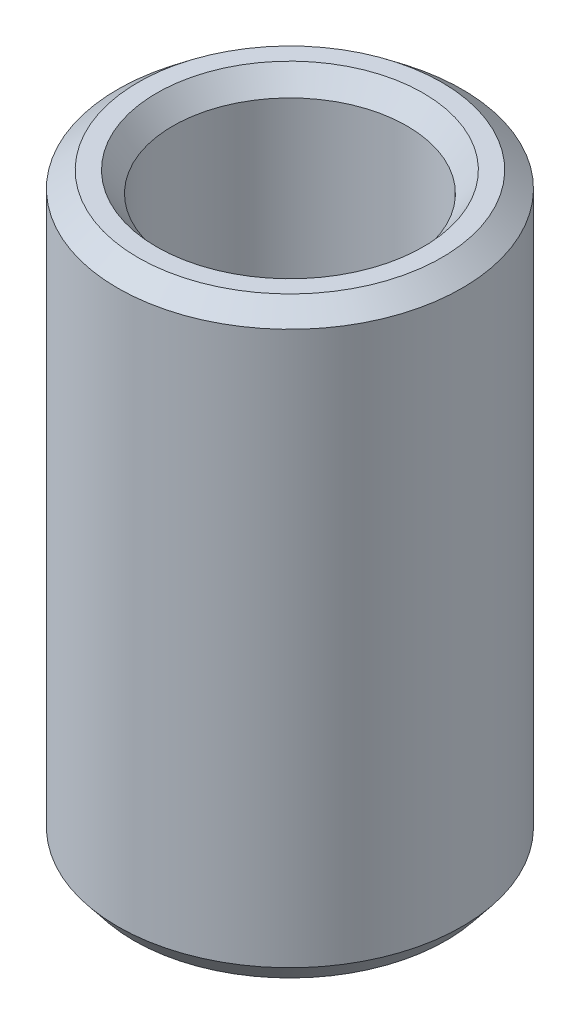
ISO-10303-21;
HEADER;
FILE_DESCRIPTION(('STEP AP214'),'2;1');
FILE_NAME('part.step','',(''),(''),'','','');
FILE_SCHEMA(('AUTOMOTIVE_DESIGN { 1 0 10303 214 1 1 1 1 }'));
ENDSEC;
DATA;
#1=APPLICATION_CONTEXT('core data for automotive mechanical design processes');
#2=APPLICATION_PROTOCOL_DEFINITION('international standard','automotive_design',2000,#1);
#3=PRODUCT_CONTEXT('',#1,'mechanical');
#4=PRODUCT('Part','Part','',(#3));
#5=PRODUCT_RELATED_PRODUCT_CATEGORY('part','',(#4));
#6=PRODUCT_DEFINITION_FORMATION('','',#4);
#7=PRODUCT_DEFINITION_CONTEXT('part definition',#1,'design');
#8=PRODUCT_DEFINITION('design','',#6,#7);
#9=PRODUCT_DEFINITION_SHAPE('','',#8);
#10=(LENGTH_UNIT() NAMED_UNIT(*) SI_UNIT(.MILLI.,.METRE.));
#11=(NAMED_UNIT(*) PLANE_ANGLE_UNIT() SI_UNIT($,.RADIAN.));
#12=(NAMED_UNIT(*) SI_UNIT($,.STERADIAN.) SOLID_ANGLE_UNIT());
#13=UNCERTAINTY_MEASURE_WITH_UNIT(LENGTH_MEASURE(1.E-05),#10,'distance_accuracy_value','');
#14=(GEOMETRIC_REPRESENTATION_CONTEXT(3) GLOBAL_UNCERTAINTY_ASSIGNED_CONTEXT((#13)) GLOBAL_UNIT_ASSIGNED_CONTEXT((#10,
#11,#12)) REPRESENTATION_CONTEXT('',''));
#15=CARTESIAN_POINT('',(0.,0.,0.));
#16=DIRECTION('',(0.,0.,1.));
#17=DIRECTION('',(1.,0.,0.));
#18=AXIS2_PLACEMENT_3D('',#15,#16,#17);
#19=CARTESIAN_POINT('',(0.,136.917324424175,0.));
#20=DIRECTION('',(0.,-1.,0.));
#21=DIRECTION('',(0.,0.,-1.));
#22=AXIS2_PLACEMENT_3D('',#19,#20,#21);
#23=CYLINDRICAL_SURFACE('',#22,40.);
#24=CARTESIAN_POINT('',(0.,4.72704175992167,0.));
#25=DIRECTION('',(0.,1.,0.));
#26=DIRECTION('',(0.,0.,1.));
#27=AXIS2_PLACEMENT_3D('',#24,#25,#26);
#28=CIRCLE('',#27,40.);
#29=CARTESIAN_POINT('',(0.,4.72704175992167,40.));
#30=VERTEX_POINT('',#29);
#31=EDGE_CURVE('E10',#30,#30,#28,.T.);
#32=ORIENTED_EDGE('',*,*,#31,.T.);
#33=EDGE_LOOP('',(#32));
#34=FACE_BOUND('',#33,.T.);
#35=CARTESIAN_POINT('',(0.,133.144575818901,0.));
#36=DIRECTION('',(0.,1.,0.));
#37=DIRECTION('',(0.,0.,1.));
#38=AXIS2_PLACEMENT_3D('',#35,#36,#37);
#39=CIRCLE('',#38,40.);
#40=CARTESIAN_POINT('',(0.,133.144575818901,40.));
#41=VERTEX_POINT('',#40);
#42=EDGE_CURVE('E50',#41,#41,#39,.F.);
#43=ORIENTED_EDGE('',*,*,#42,.T.);
#44=EDGE_LOOP('',(#43));
#45=FACE_BOUND('',#44,.T.);
#46=ADVANCED_FACE('F39',(#34,#45),#23,.T.);
#47=CARTESIAN_POINT('',(0.,136.917324424175,0.));
#48=DIRECTION('',(0.,1.,0.));
#49=DIRECTION('',(0.,0.,1.));
#50=AXIS2_PLACEMENT_3D('',#47,#48,#49);
#51=PLANE('',#50);
#52=CARTESIAN_POINT('',(0.,136.917324424175,0.));
#53=DIRECTION('',(0.,1.,0.));
#54=DIRECTION('',(0.,0.,1.));
#55=AXIS2_PLACEMENT_3D('',#52,#53,#54);
#56=CIRCLE('',#55,30.955657486322);
#57=CARTESIAN_POINT('',(0.,136.917324424175,30.955657486322));
#58=VERTEX_POINT('',#57);
#59=EDGE_CURVE('E58',#58,#58,#56,.F.);
#60=ORIENTED_EDGE('',*,*,#59,.T.);
#61=EDGE_LOOP('',(#60));
#62=FACE_BOUND('',#61,.T.);
#63=CARTESIAN_POINT('',(0.,136.917324424175,0.));
#64=DIRECTION('',(0.,1.,0.));
#65=DIRECTION('',(0.,0.,1.));
#66=AXIS2_PLACEMENT_3D('',#63,#64,#65);
#67=CIRCLE('',#66,35.2729582400783);
#68=CARTESIAN_POINT('',(0.,136.917324424175,35.2729582400783));
#69=VERTEX_POINT('',#68);
#70=EDGE_CURVE('E61',#69,#69,#67,.T.);
#71=ORIENTED_EDGE('',*,*,#70,.T.);
#72=EDGE_LOOP('',(#71));
#73=FACE_BOUND('',#72,.T.);
#74=ADVANCED_FACE('F88',(#62,#73),#51,.T.);
#75=CARTESIAN_POINT('',(0.,0.,0.));
#76=DIRECTION('',(0.,1.,0.));
#77=DIRECTION('',(0.,0.,1.));
#78=AXIS2_PLACEMENT_3D('',#75,#76,#77);
#79=PLANE('',#78);
#80=CARTESIAN_POINT('',(0.,0.,0.));
#81=DIRECTION('',(0.,1.,0.));
#82=DIRECTION('',(0.,0.,1.));
#83=AXIS2_PLACEMENT_3D('',#80,#81,#82);
#84=CIRCLE('',#83,31.9099506409698);
#85=CARTESIAN_POINT('',(0.,0.,31.9099506409698));
#86=VERTEX_POINT('',#85);
#87=EDGE_CURVE('E51',#86,#86,#84,.T.);
#88=ORIENTED_EDGE('',*,*,#87,.T.);
#89=EDGE_LOOP('',(#88));
#90=FACE_BOUND('',#89,.T.);
#91=CARTESIAN_POINT('',(0.,0.,0.));
#92=DIRECTION('',(0.,1.,0.));
#93=DIRECTION('',(0.,0.,1.));
#94=AXIS2_PLACEMENT_3D('',#91,#92,#93);
#95=CIRCLE('',#94,36.2272513947261);
#96=CARTESIAN_POINT('',(0.,0.,36.2272513947261));
#97=VERTEX_POINT('',#96);
#98=EDGE_CURVE('E54',#97,#97,#95,.F.);
#99=ORIENTED_EDGE('',*,*,#98,.T.);
#100=EDGE_LOOP('',(#99));
#101=FACE_BOUND('',#100,.T.);
#102=ADVANCED_FACE('F83',(#90,#101),#79,.F.);
#103=CARTESIAN_POINT('',(0.,136.917324424175,0.));
#104=DIRECTION('',(0.,-1.,0.));
#105=DIRECTION('',(0.,0.,-1.));
#106=AXIS2_PLACEMENT_3D('',#103,#104,#105);
#107=CYLINDRICAL_SURFACE('',#106,27.1829088810481);
#108=CARTESIAN_POINT('',(0.,132.190282664253,0.));
#109=DIRECTION('',(0.,1.,0.));
#110=DIRECTION('',(0.,0.,1.));
#111=AXIS2_PLACEMENT_3D('',#108,#109,#110);
#112=CIRCLE('',#111,27.1829088810481);
#113=CARTESIAN_POINT('',(0.,132.190282664253,27.1829088810481));
#114=VERTEX_POINT('',#113);
#115=EDGE_CURVE('E67',#114,#114,#112,.T.);
#116=ORIENTED_EDGE('',*,*,#115,.T.);
#117=EDGE_LOOP('',(#116));
#118=FACE_BOUND('',#117,.T.);
#119=CARTESIAN_POINT('',(0.,3.77274860527393,0.));
#120=DIRECTION('',(0.,1.,0.));
#121=DIRECTION('',(0.,0.,1.));
#122=AXIS2_PLACEMENT_3D('',#119,#120,#121);
#123=CIRCLE('',#122,27.1829088810481);
#124=CARTESIAN_POINT('',(0.,3.77274860527393,27.1829088810481));
#125=VERTEX_POINT('',#124);
#126=EDGE_CURVE('E69',#125,#125,#123,.F.);
#127=ORIENTED_EDGE('',*,*,#126,.T.);
#128=EDGE_LOOP('',(#127));
#129=FACE_BOUND('',#128,.T.);
#130=ADVANCED_FACE('F71',(#118,#129),#107,.F.);
#131=CARTESIAN_POINT('',(0.,132.190282664253,0.));
#132=DIRECTION('',(0.,1.,0.));
#133=DIRECTION('',(0.,0.,1.));
#134=AXIS2_PLACEMENT_3D('',#131,#132,#133);
#135=CONICAL_SURFACE('',#134,27.1829088810481,0.673593812111722);
#136=ORIENTED_EDGE('',*,*,#59,.F.);
#137=EDGE_LOOP('',(#136));
#138=FACE_BOUND('',#137,.T.);
#139=ORIENTED_EDGE('',*,*,#115,.F.);
#140=EDGE_LOOP('',(#139));
#141=FACE_BOUND('',#140,.T.);
#142=ADVANCED_FACE('F77',(#138,#141),#135,.F.);
#143=CARTESIAN_POINT('',(0.,0.,0.));
#144=DIRECTION('',(0.,-1.,0.));
#145=DIRECTION('',(0.,0.,-1.));
#146=AXIS2_PLACEMENT_3D('',#143,#144,#145);
#147=CONICAL_SURFACE('',#146,31.9099506409698,0.897202514683172);
#148=ORIENTED_EDGE('',*,*,#126,.F.);
#149=EDGE_LOOP('',(#148));
#150=FACE_BOUND('',#149,.T.);
#151=ORIENTED_EDGE('',*,*,#87,.F.);
#152=EDGE_LOOP('',(#151));
#153=FACE_BOUND('',#152,.T.);
#154=ADVANCED_FACE('F73',(#150,#153),#147,.F.);
#155=CARTESIAN_POINT('',(0.,4.72704175992167,0.));
#156=DIRECTION('',(0.,1.,0.));
#157=DIRECTION('',(0.,0.,1.));
#158=AXIS2_PLACEMENT_3D('',#155,#156,#157);
#159=CONICAL_SURFACE('',#158,40.,0.673593812111725);
#160=ORIENTED_EDGE('',*,*,#98,.F.);
#161=EDGE_LOOP('',(#160));
#162=FACE_BOUND('',#161,.T.);
#163=ORIENTED_EDGE('',*,*,#31,.F.);
#164=EDGE_LOOP('',(#163));
#165=FACE_BOUND('',#164,.T.);
#166=ADVANCED_FACE('F76',(#162,#165),#159,.T.);
#167=CARTESIAN_POINT('',(0.,136.917324424175,0.));
#168=DIRECTION('',(0.,-1.,0.));
#169=DIRECTION('',(0.,0.,-1.));
#170=AXIS2_PLACEMENT_3D('',#167,#168,#169);
#171=CONICAL_SURFACE('',#170,35.2729582400783,0.897202514683175);
#172=ORIENTED_EDGE('',*,*,#42,.F.);
#173=EDGE_LOOP('',(#172));
#174=FACE_BOUND('',#173,.T.);
#175=ORIENTED_EDGE('',*,*,#70,.F.);
#176=EDGE_LOOP('',(#175));
#177=FACE_BOUND('',#176,.T.);
#178=ADVANCED_FACE('F45',(#174,#177),#171,.T.);
#179=CLOSED_SHELL('',(#46,#74,#102,#130,#142,#154,#166,#178));
#180=MANIFOLD_SOLID_BREP('B2',#179);
#181=ADVANCED_BREP_SHAPE_REPRESENTATION('',(#18,#180),#14);
#182=SHAPE_DEFINITION_REPRESENTATION(#9,#181);
ENDSEC;
END-ISO-10303-21;
